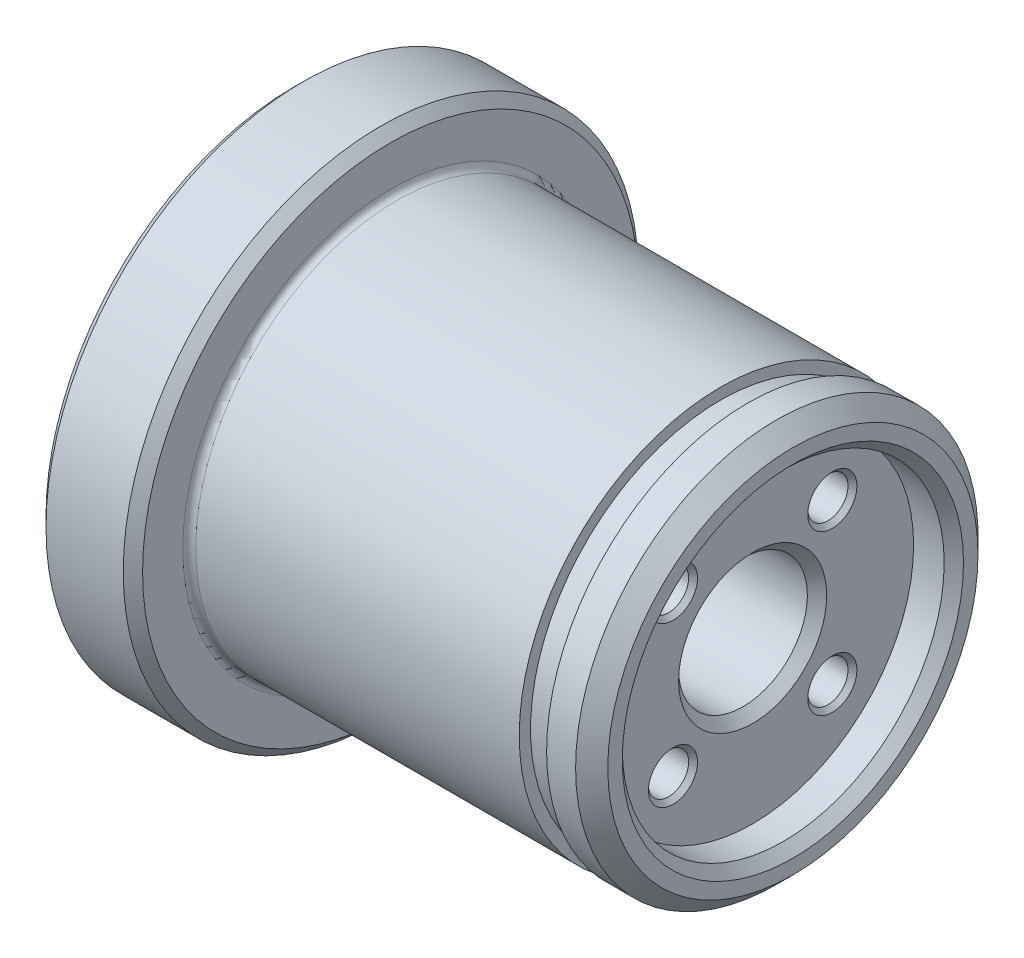
ISO-10303-21;
HEADER;
FILE_DESCRIPTION(('STEP AP214'),'2;1');
FILE_NAME('part.step','',(''),(''),'','','');
FILE_SCHEMA(('AUTOMOTIVE_DESIGN { 1 0 10303 214 1 1 1 1 }'));
ENDSEC;
DATA;
#1=APPLICATION_CONTEXT('core data for automotive mechanical design processes');
#2=APPLICATION_PROTOCOL_DEFINITION('international standard','automotive_design',2000,#1);
#3=PRODUCT_CONTEXT('',#1,'mechanical');
#4=PRODUCT('Part','Part','',(#3));
#5=PRODUCT_RELATED_PRODUCT_CATEGORY('part','',(#4));
#6=PRODUCT_DEFINITION_FORMATION('','',#4);
#7=PRODUCT_DEFINITION_CONTEXT('part definition',#1,'design');
#8=PRODUCT_DEFINITION('design','',#6,#7);
#9=PRODUCT_DEFINITION_SHAPE('','',#8);
#10=(LENGTH_UNIT() NAMED_UNIT(*) SI_UNIT(.MILLI.,.METRE.));
#11=(NAMED_UNIT(*) PLANE_ANGLE_UNIT() SI_UNIT($,.RADIAN.));
#12=(NAMED_UNIT(*) SI_UNIT($,.STERADIAN.) SOLID_ANGLE_UNIT());
#13=UNCERTAINTY_MEASURE_WITH_UNIT(LENGTH_MEASURE(1.E-05),#10,'distance_accuracy_value','');
#14=(GEOMETRIC_REPRESENTATION_CONTEXT(3) GLOBAL_UNCERTAINTY_ASSIGNED_CONTEXT((#13)) GLOBAL_UNIT_ASSIGNED_CONTEXT((#10,
#11,#12)) REPRESENTATION_CONTEXT('',''));
#15=CARTESIAN_POINT('',(0.,0.,0.));
#16=DIRECTION('',(0.,0.,1.));
#17=DIRECTION('',(1.,0.,0.));
#18=AXIS2_PLACEMENT_3D('',#15,#16,#17);
#19=CARTESIAN_POINT('',(0.,0.,0.));
#20=DIRECTION('',(-1.,0.,0.));
#21=DIRECTION('',(0.,0.,1.));
#22=AXIS2_PLACEMENT_3D('',#19,#20,#21);
#23=CYLINDRICAL_SURFACE('',#22,12.5);
#24=CARTESIAN_POINT('',(-24.6,0.,0.));
#25=DIRECTION('',(-1.,0.,0.));
#26=DIRECTION('',(0.,0.,1.));
#27=AXIS2_PLACEMENT_3D('',#24,#25,#26);
#28=CIRCLE('',#27,12.5);
#29=CARTESIAN_POINT('',(-24.6,0.,12.5));
#30=VERTEX_POINT('',#29);
#31=EDGE_CURVE('E176',#30,#30,#28,.F.);
#32=ORIENTED_EDGE('',*,*,#31,.T.);
#33=EDGE_LOOP('',(#32));
#34=FACE_BOUND('',#33,.T.);
#35=CARTESIAN_POINT('',(-4.50000000000001,0.,0.));
#36=DIRECTION('',(1.,0.,0.));
#37=DIRECTION('',(0.,0.,-1.));
#38=AXIS2_PLACEMENT_3D('',#35,#36,#37);
#39=CIRCLE('',#38,12.5);
#40=CARTESIAN_POINT('',(-4.50000000000001,0.,-12.5));
#41=VERTEX_POINT('',#40);
#42=EDGE_CURVE('E164',#41,#41,#39,.T.);
#43=ORIENTED_EDGE('',*,*,#42,.F.);
#44=EDGE_LOOP('',(#43));
#45=FACE_BOUND('',#44,.T.);
#46=ADVANCED_FACE('F39',(#34,#45),#23,.T.);
#47=CARTESIAN_POINT('',(-25.,12.5,0.));
#48=DIRECTION('',(-1.,0.,0.));
#49=DIRECTION('',(0.,0.,1.));
#50=AXIS2_PLACEMENT_3D('',#47,#48,#49);
#51=PLANE('',#50);
#52=CARTESIAN_POINT('',(-25.,0.,0.));
#53=DIRECTION('',(-1.,0.,0.));
#54=DIRECTION('',(0.,0.,1.));
#55=AXIS2_PLACEMENT_3D('',#52,#53,#54);
#56=CIRCLE('',#55,15.4);
#57=CARTESIAN_POINT('',(-25.,0.,15.4));
#58=VERTEX_POINT('',#57);
#59=EDGE_CURVE('E11',#58,#58,#56,.F.);
#60=ORIENTED_EDGE('',*,*,#59,.T.);
#61=EDGE_LOOP('',(#60));
#62=FACE_BOUND('',#61,.T.);
#63=CARTESIAN_POINT('',(-25.,0.,0.));
#64=DIRECTION('',(-1.,0.,0.));
#65=DIRECTION('',(0.,0.,1.));
#66=AXIS2_PLACEMENT_3D('',#63,#64,#65);
#67=CIRCLE('',#66,12.9);
#68=CARTESIAN_POINT('',(-25.,0.,12.9));
#69=VERTEX_POINT('',#68);
#70=EDGE_CURVE('E173',#69,#69,#67,.T.);
#71=ORIENTED_EDGE('',*,*,#70,.T.);
#72=EDGE_LOOP('',(#71));
#73=FACE_BOUND('',#72,.T.);
#74=ADVANCED_FACE('F249',(#62,#73),#51,.F.);
#75=CARTESIAN_POINT('',(0.,0.,0.));
#76=DIRECTION('',(-1.,0.,0.));
#77=DIRECTION('',(0.,0.,1.));
#78=AXIS2_PLACEMENT_3D('',#75,#76,#77);
#79=CYLINDRICAL_SURFACE('',#78,16.);
#80=CARTESIAN_POINT('',(-30.4,0.,0.));
#81=DIRECTION('',(1.,0.,0.));
#82=DIRECTION('',(0.,0.,-1.));
#83=AXIS2_PLACEMENT_3D('',#80,#81,#82);
#84=CIRCLE('',#83,16.);
#85=CARTESIAN_POINT('',(-30.4,0.,-16.));
#86=VERTEX_POINT('',#85);
#87=EDGE_CURVE('E47',#86,#86,#84,.T.);
#88=ORIENTED_EDGE('',*,*,#87,.T.);
#89=EDGE_LOOP('',(#88));
#90=FACE_BOUND('',#89,.T.);
#91=CARTESIAN_POINT('',(-25.6,0.,0.));
#92=DIRECTION('',(-1.,0.,0.));
#93=DIRECTION('',(0.,0.,1.));
#94=AXIS2_PLACEMENT_3D('',#91,#92,#93);
#95=CIRCLE('',#94,16.);
#96=CARTESIAN_POINT('',(-25.6,0.,16.));
#97=VERTEX_POINT('',#96);
#98=EDGE_CURVE('E200',#97,#97,#95,.T.);
#99=ORIENTED_EDGE('',*,*,#98,.T.);
#100=EDGE_LOOP('',(#99));
#101=FACE_BOUND('',#100,.T.);
#102=ADVANCED_FACE('F205',(#90,#101),#79,.T.);
#103=CARTESIAN_POINT('',(-31.,16.,0.));
#104=DIRECTION('',(1.,0.,0.));
#105=DIRECTION('',(0.,0.,-1.));
#106=AXIS2_PLACEMENT_3D('',#103,#104,#105);
#107=PLANE('',#106);
#108=CARTESIAN_POINT('',(-31.,0.,0.));
#109=DIRECTION('',(1.,0.,0.));
#110=DIRECTION('',(0.,0.,-1.));
#111=AXIS2_PLACEMENT_3D('',#108,#109,#110);
#112=CIRCLE('',#111,15.4);
#113=CARTESIAN_POINT('',(-31.,0.,-15.4));
#114=VERTEX_POINT('',#113);
#115=EDGE_CURVE('E197',#114,#114,#112,.F.);
#116=ORIENTED_EDGE('',*,*,#115,.T.);
#117=EDGE_LOOP('',(#116));
#118=FACE_BOUND('',#117,.T.);
#119=CARTESIAN_POINT('',(-31.,-7.07106781186549,7.07106781186547));
#120=DIRECTION('',(-1.,0.,0.));
#121=DIRECTION('',(0.,-1.,0.));
#122=AXIS2_PLACEMENT_3D('',#119,#120,#121);
#123=CIRCLE('',#122,1.525);
#124=CARTESIAN_POINT('',(-31.,-8.59606781186549,7.07106781186546));
#125=VERTEX_POINT('',#124);
#126=EDGE_CURVE('E89',#125,#125,#123,.T.);
#127=ORIENTED_EDGE('',*,*,#126,.F.);
#128=EDGE_LOOP('',(#127));
#129=FACE_BOUND('',#128,.T.);
#130=CARTESIAN_POINT('',(-31.,-7.07106781186549,-7.07106781186546));
#131=DIRECTION('',(-1.,0.,0.));
#132=DIRECTION('',(0.,0.,-1.));
#133=AXIS2_PLACEMENT_3D('',#130,#131,#132);
#134=CIRCLE('',#133,1.525);
#135=CARTESIAN_POINT('',(-31.,-7.07106781186549,-8.59606781186546));
#136=VERTEX_POINT('',#135);
#137=EDGE_CURVE('E93',#136,#136,#134,.T.);
#138=ORIENTED_EDGE('',*,*,#137,.F.);
#139=EDGE_LOOP('',(#138));
#140=FACE_BOUND('',#139,.T.);
#141=CARTESIAN_POINT('',(-31.,7.07106781186554,-7.07106781186542));
#142=DIRECTION('',(-1.,0.,0.));
#143=DIRECTION('',(0.,1.,0.));
#144=AXIS2_PLACEMENT_3D('',#141,#142,#143);
#145=CIRCLE('',#144,1.525);
#146=CARTESIAN_POINT('',(-31.,8.59606781186554,-7.0710678118654));
#147=VERTEX_POINT('',#146);
#148=EDGE_CURVE('E103',#147,#147,#145,.T.);
#149=ORIENTED_EDGE('',*,*,#148,.F.);
#150=EDGE_LOOP('',(#149));
#151=FACE_BOUND('',#150,.T.);
#152=CARTESIAN_POINT('',(-31.,7.07106781186549,7.07106781186546));
#153=DIRECTION('',(-1.,0.,0.));
#154=DIRECTION('',(0.,0.,1.));
#155=AXIS2_PLACEMENT_3D('',#152,#153,#154);
#156=CIRCLE('',#155,1.525);
#157=CARTESIAN_POINT('',(-31.,7.07106781186549,8.59606781186546));
#158=VERTEX_POINT('',#157);
#159=EDGE_CURVE('E82',#158,#158,#156,.T.);
#160=ORIENTED_EDGE('',*,*,#159,.F.);
#161=EDGE_LOOP('',(#160));
#162=FACE_BOUND('',#161,.T.);
#163=CARTESIAN_POINT('',(-31.,0.,0.));
#164=DIRECTION('',(1.,0.,0.));
#165=DIRECTION('',(0.,0.,-1.));
#166=AXIS2_PLACEMENT_3D('',#163,#164,#165);
#167=CIRCLE('',#166,4.59999999999999);
#168=CARTESIAN_POINT('',(-31.,0.,-4.59999999999999));
#169=VERTEX_POINT('',#168);
#170=EDGE_CURVE('E185',#169,#169,#167,.T.);
#171=ORIENTED_EDGE('',*,*,#170,.T.);
#172=EDGE_LOOP('',(#171));
#173=FACE_BOUND('',#172,.T.);
#174=ADVANCED_FACE('F214',(#118,#129,#140,#151,#162,#173),#107,.F.);
#175=CARTESIAN_POINT('',(-4.50000000000001,12.5,0.));
#176=DIRECTION('',(-1.,0.,0.));
#177=DIRECTION('',(0.,0.,1.));
#178=AXIS2_PLACEMENT_3D('',#175,#176,#177);
#179=PLANE('',#178);
#180=CARTESIAN_POINT('',(-4.50000000000001,0.,0.));
#181=DIRECTION('',(1.,0.,0.));
#182=DIRECTION('',(0.,0.,-1.));
#183=AXIS2_PLACEMENT_3D('',#180,#181,#182);
#184=CIRCLE('',#183,11.8);
#185=CARTESIAN_POINT('',(-4.50000000000001,0.,-11.8));
#186=VERTEX_POINT('',#185);
#187=EDGE_CURVE('E161',#186,#186,#184,.T.);
#188=ORIENTED_EDGE('',*,*,#187,.F.);
#189=EDGE_LOOP('',(#188));
#190=FACE_BOUND('',#189,.T.);
#191=ORIENTED_EDGE('',*,*,#42,.T.);
#192=EDGE_LOOP('',(#191));
#193=FACE_BOUND('',#192,.T.);
#194=ADVANCED_FACE('F217',(#190,#193),#179,.F.);
#195=CARTESIAN_POINT('',(0.,0.,0.));
#196=DIRECTION('',(1.,0.,0.));
#197=DIRECTION('',(0.,0.,-1.));
#198=AXIS2_PLACEMENT_3D('',#195,#196,#197);
#199=CYLINDRICAL_SURFACE('',#198,11.8);
#200=CARTESIAN_POINT('',(-2.80000000000001,0.,0.));
#201=DIRECTION('',(1.,0.,0.));
#202=DIRECTION('',(0.,0.,-1.));
#203=AXIS2_PLACEMENT_3D('',#200,#201,#202);
#204=CIRCLE('',#203,11.8);
#205=CARTESIAN_POINT('',(-2.80000000000001,0.,-11.8));
#206=VERTEX_POINT('',#205);
#207=EDGE_CURVE('E158',#206,#206,#204,.T.);
#208=ORIENTED_EDGE('',*,*,#207,.F.);
#209=EDGE_LOOP('',(#208));
#210=FACE_BOUND('',#209,.T.);
#211=ORIENTED_EDGE('',*,*,#187,.T.);
#212=EDGE_LOOP('',(#211));
#213=FACE_BOUND('',#212,.T.);
#214=ADVANCED_FACE('F279',(#210,#213),#199,.T.);
#215=CARTESIAN_POINT('',(-2.80000000000001,11.8,0.));
#216=DIRECTION('',(1.,0.,0.));
#217=DIRECTION('',(0.,0.,-1.));
#218=AXIS2_PLACEMENT_3D('',#215,#216,#217);
#219=PLANE('',#218);
#220=CARTESIAN_POINT('',(-2.80000000000001,0.,0.));
#221=DIRECTION('',(1.,0.,0.));
#222=DIRECTION('',(0.,0.,-1.));
#223=AXIS2_PLACEMENT_3D('',#220,#221,#222);
#224=CIRCLE('',#223,12.5);
#225=CARTESIAN_POINT('',(-2.80000000000001,0.,-12.5));
#226=VERTEX_POINT('',#225);
#227=EDGE_CURVE('E155',#226,#226,#224,.T.);
#228=ORIENTED_EDGE('',*,*,#227,.F.);
#229=EDGE_LOOP('',(#228));
#230=FACE_BOUND('',#229,.T.);
#231=ORIENTED_EDGE('',*,*,#207,.T.);
#232=EDGE_LOOP('',(#231));
#233=FACE_BOUND('',#232,.T.);
#234=ADVANCED_FACE('F271',(#230,#233),#219,.F.);
#235=CARTESIAN_POINT('',(0.,0.,0.));
#236=DIRECTION('',(-1.,0.,0.));
#237=DIRECTION('',(0.,0.,1.));
#238=AXIS2_PLACEMENT_3D('',#235,#236,#237);
#239=PLANE('',#238);
#240=CARTESIAN_POINT('',(0.,0.,0.));
#241=DIRECTION('',(-1.,0.,0.));
#242=DIRECTION('',(0.,0.,1.));
#243=AXIS2_PLACEMENT_3D('',#240,#241,#242);
#244=CIRCLE('',#243,10.6);
#245=CARTESIAN_POINT('',(0.,0.,10.6));
#246=VERTEX_POINT('',#245);
#247=EDGE_CURVE('E182',#246,#246,#244,.T.);
#248=ORIENTED_EDGE('',*,*,#247,.T.);
#249=EDGE_LOOP('',(#248));
#250=FACE_BOUND('',#249,.T.);
#251=CARTESIAN_POINT('',(0.,0.,0.));
#252=DIRECTION('',(-1.,0.,0.));
#253=DIRECTION('',(0.,0.,1.));
#254=AXIS2_PLACEMENT_3D('',#251,#252,#253);
#255=CIRCLE('',#254,11.5);
#256=CARTESIAN_POINT('',(0.,0.,11.5));
#257=VERTEX_POINT('',#256);
#258=EDGE_CURVE('E170',#257,#257,#255,.F.);
#259=ORIENTED_EDGE('',*,*,#258,.T.);
#260=EDGE_LOOP('',(#259));
#261=FACE_BOUND('',#260,.T.);
#262=ADVANCED_FACE('F262',(#250,#261),#239,.F.);
#263=CARTESIAN_POINT('',(-0.999999999999996,0.,0.));
#264=DIRECTION('',(-1.,0.,0.));
#265=DIRECTION('',(0.,0.,1.));
#266=AXIS2_PLACEMENT_3D('',#263,#264,#265);
#267=CIRCLE('',#266,12.5);
#268=CARTESIAN_POINT('',(-0.999999999999996,0.,12.5));
#269=VERTEX_POINT('',#268);
#270=EDGE_CURVE('E167',#269,#269,#267,.T.);
#271=ORIENTED_EDGE('',*,*,#270,.T.);
#272=EDGE_LOOP('',(#271));
#273=FACE_BOUND('',#272,.T.);
#274=ORIENTED_EDGE('',*,*,#227,.T.);
#275=EDGE_LOOP('',(#274));
#276=FACE_BOUND('',#275,.T.);
#277=ADVANCED_FACE('F252',(#273,#276),#23,.T.);
#278=CARTESIAN_POINT('',(-0.999999999999996,0.,0.));
#279=DIRECTION('',(-1.,0.,0.));
#280=DIRECTION('',(0.,0.,1.));
#281=AXIS2_PLACEMENT_3D('',#278,#279,#280);
#282=CONICAL_SURFACE('',#281,12.5,0.785398163397451);
#283=ORIENTED_EDGE('',*,*,#258,.F.);
#284=EDGE_LOOP('',(#283));
#285=FACE_BOUND('',#284,.T.);
#286=ORIENTED_EDGE('',*,*,#270,.F.);
#287=EDGE_LOOP('',(#286));
#288=FACE_BOUND('',#287,.T.);
#289=ADVANCED_FACE('F261',(#285,#288),#282,.T.);
#290=CARTESIAN_POINT('',(-24.6,0.,0.));
#291=DIRECTION('',(-1.,0.,0.));
#292=DIRECTION('',(0.,0.,1.));
#293=AXIS2_PLACEMENT_3D('',#290,#291,#292);
#294=TOROIDAL_SURFACE('',#293,12.9,0.4);
#295=ORIENTED_EDGE('',*,*,#31,.F.);
#296=EDGE_LOOP('',(#295));
#297=FACE_BOUND('',#296,.T.);
#298=ORIENTED_EDGE('',*,*,#70,.F.);
#299=EDGE_LOOP('',(#298));
#300=FACE_BOUND('',#299,.T.);
#301=ADVANCED_FACE('F268',(#297,#300),#294,.F.);
#302=CARTESIAN_POINT('',(0.,0.,0.));
#303=DIRECTION('',(1.,0.,0.));
#304=DIRECTION('',(0.,0.,-1.));
#305=AXIS2_PLACEMENT_3D('',#302,#303,#304);
#306=CYLINDRICAL_SURFACE('',#305,10.);
#307=CARTESIAN_POINT('',(-0.599999999999998,0.,0.));
#308=DIRECTION('',(-1.,0.,0.));
#309=DIRECTION('',(0.,0.,1.));
#310=AXIS2_PLACEMENT_3D('',#307,#308,#309);
#311=CIRCLE('',#310,10.);
#312=CARTESIAN_POINT('',(-0.599999999999998,0.,10.));
#313=VERTEX_POINT('',#312);
#314=EDGE_CURVE('E179',#313,#313,#311,.F.);
#315=ORIENTED_EDGE('',*,*,#314,.T.);
#316=EDGE_LOOP('',(#315));
#317=FACE_BOUND('',#316,.T.);
#318=CARTESIAN_POINT('',(-2.5,0.,0.));
#319=DIRECTION('',(1.,0.,0.));
#320=DIRECTION('',(0.,0.,-1.));
#321=AXIS2_PLACEMENT_3D('',#318,#319,#320);
#322=CIRCLE('',#321,10.);
#323=CARTESIAN_POINT('',(-2.5,0.,-10.));
#324=VERTEX_POINT('',#323);
#325=EDGE_CURVE('E152',#324,#324,#322,.T.);
#326=ORIENTED_EDGE('',*,*,#325,.F.);
#327=EDGE_LOOP('',(#326));
#328=FACE_BOUND('',#327,.T.);
#329=ADVANCED_FACE('F332',(#317,#328),#306,.F.);
#330=CARTESIAN_POINT('',(-2.5,10.,0.));
#331=DIRECTION('',(-1.,0.,0.));
#332=DIRECTION('',(0.,0.,1.));
#333=AXIS2_PLACEMENT_3D('',#330,#331,#332);
#334=PLANE('',#333);
#335=CARTESIAN_POINT('',(-2.5,0.,0.));
#336=DIRECTION('',(-1.,0.,0.));
#337=DIRECTION('',(0.,0.,1.));
#338=AXIS2_PLACEMENT_3D('',#335,#336,#337);
#339=CIRCLE('',#338,4.59999999999998);
#340=CARTESIAN_POINT('',(-2.5,0.,4.59999999999998));
#341=VERTEX_POINT('',#340);
#342=EDGE_CURVE('E194',#341,#341,#339,.T.);
#343=ORIENTED_EDGE('',*,*,#342,.T.);
#344=EDGE_LOOP('',(#343));
#345=FACE_BOUND('',#344,.T.);
#346=CARTESIAN_POINT('',(-2.5,4.94974746830588,4.94974746830578));
#347=DIRECTION('',(1.,0.,0.));
#348=DIRECTION('',(0.,0.,-1.));
#349=AXIS2_PLACEMENT_3D('',#346,#347,#348);
#350=CIRCLE('',#349,1.525);
#351=CARTESIAN_POINT('',(-2.5,4.94974746830588,3.42474746830578));
#352=VERTEX_POINT('',#351);
#353=EDGE_CURVE('E116',#352,#352,#350,.T.);
#354=ORIENTED_EDGE('',*,*,#353,.F.);
#355=EDGE_LOOP('',(#354));
#356=FACE_BOUND('',#355,.T.);
#357=CARTESIAN_POINT('',(-2.5,-4.94974746830583,4.94974746830583));
#358=DIRECTION('',(1.,0.,0.));
#359=DIRECTION('',(0.,0.,-1.));
#360=AXIS2_PLACEMENT_3D('',#357,#358,#359);
#361=CIRCLE('',#360,1.525);
#362=CARTESIAN_POINT('',(-2.5,-4.94974746830583,3.42474746830583));
#363=VERTEX_POINT('',#362);
#364=EDGE_CURVE('E125',#363,#363,#361,.T.);
#365=ORIENTED_EDGE('',*,*,#364,.F.);
#366=EDGE_LOOP('',(#365));
#367=FACE_BOUND('',#366,.T.);
#368=CARTESIAN_POINT('',(-2.5,-4.94974746830585,-4.94974746830581));
#369=DIRECTION('',(1.,0.,0.));
#370=DIRECTION('',(0.,0.,-1.));
#371=AXIS2_PLACEMENT_3D('',#368,#369,#370);
#372=CIRCLE('',#371,1.525);
#373=CARTESIAN_POINT('',(-2.5,-4.94974746830585,-6.47474746830582));
#374=VERTEX_POINT('',#373);
#375=EDGE_CURVE('E134',#374,#374,#372,.T.);
#376=ORIENTED_EDGE('',*,*,#375,.F.);
#377=EDGE_LOOP('',(#376));
#378=FACE_BOUND('',#377,.T.);
#379=CARTESIAN_POINT('',(-2.5,4.94974746830583,-4.94974746830583));
#380=DIRECTION('',(1.,0.,0.));
#381=DIRECTION('',(0.,0.,-1.));
#382=AXIS2_PLACEMENT_3D('',#379,#380,#381);
#383=CIRCLE('',#382,1.525);
#384=CARTESIAN_POINT('',(-2.5,4.94974746830583,-6.47474746830583));
#385=VERTEX_POINT('',#384);
#386=EDGE_CURVE('E143',#385,#385,#383,.T.);
#387=ORIENTED_EDGE('',*,*,#386,.F.);
#388=EDGE_LOOP('',(#387));
#389=FACE_BOUND('',#388,.T.);
#390=ORIENTED_EDGE('',*,*,#325,.T.);
#391=EDGE_LOOP('',(#390));
#392=FACE_BOUND('',#391,.T.);
#393=ADVANCED_FACE('F338',(#345,#356,#367,#378,#389,#392),#334,.F.);
#394=CARTESIAN_POINT('',(-9.5,4.94974746830583,-4.94974746830583));
#395=DIRECTION('',(1.,0.,0.));
#396=DIRECTION('',(0.,0.,-1.));
#397=AXIS2_PLACEMENT_3D('',#394,#395,#396);
#398=CONICAL_SURFACE('',#397,1.25,1.02974425867665);
#399=CARTESIAN_POINT('',(-10.2510757737845,4.94974746830583,-4.94974746830583));
#400=VERTEX_POINT('',#399);
#401=VERTEX_LOOP('',#400);
#402=FACE_BOUND('',#401,.T.);
#403=CARTESIAN_POINT('',(-9.5,4.94974746830583,-4.94974746830583));
#404=DIRECTION('',(1.,0.,0.));
#405=DIRECTION('',(0.,0.,-1.));
#406=AXIS2_PLACEMENT_3D('',#403,#404,#405);
#407=CIRCLE('',#406,1.25);
#408=CARTESIAN_POINT('',(-9.5,4.94974746830583,-6.19974746830583));
#409=VERTEX_POINT('',#408);
#410=EDGE_CURVE('E149',#409,#409,#407,.T.);
#411=ORIENTED_EDGE('',*,*,#410,.T.);
#412=EDGE_LOOP('',(#411));
#413=FACE_BOUND('',#412,.T.);
#414=ADVANCED_FACE('F358',(#402,#413),#398,.F.);
#415=CARTESIAN_POINT('',(-2.5,4.94974746830583,-4.94974746830583));
#416=DIRECTION('',(1.,0.,0.));
#417=DIRECTION('',(0.,0.,-1.));
#418=AXIS2_PLACEMENT_3D('',#415,#416,#417);
#419=CYLINDRICAL_SURFACE('',#418,1.25);
#420=ORIENTED_EDGE('',*,*,#410,.F.);
#421=EDGE_LOOP('',(#420));
#422=FACE_BOUND('',#421,.T.);
#423=CARTESIAN_POINT('',(-2.775,4.94974746830583,-4.94974746830583));
#424=DIRECTION('',(1.,0.,0.));
#425=DIRECTION('',(0.,0.,-1.));
#426=AXIS2_PLACEMENT_3D('',#423,#424,#425);
#427=CIRCLE('',#426,1.25);
#428=CARTESIAN_POINT('',(-2.775,4.94974746830583,-6.19974746830583));
#429=VERTEX_POINT('',#428);
#430=EDGE_CURVE('E146',#429,#429,#427,.T.);
#431=ORIENTED_EDGE('',*,*,#430,.T.);
#432=EDGE_LOOP('',(#431));
#433=FACE_BOUND('',#432,.T.);
#434=ADVANCED_FACE('F364',(#422,#433),#419,.F.);
#435=CARTESIAN_POINT('',(-2.5,4.94974746830583,-4.94974746830583));
#436=DIRECTION('',(1.,0.,0.));
#437=DIRECTION('',(0.,0.,-1.));
#438=AXIS2_PLACEMENT_3D('',#435,#436,#437);
#439=CONICAL_SURFACE('',#438,1.525,0.78539816339745);
#440=ORIENTED_EDGE('',*,*,#430,.F.);
#441=EDGE_LOOP('',(#440));
#442=FACE_BOUND('',#441,.T.);
#443=ORIENTED_EDGE('',*,*,#386,.T.);
#444=EDGE_LOOP('',(#443));
#445=FACE_BOUND('',#444,.T.);
#446=ADVANCED_FACE('F370',(#442,#445),#439,.F.);
#447=CARTESIAN_POINT('',(-9.5,-4.94974746830585,-4.94974746830581));
#448=DIRECTION('',(1.,0.,0.));
#449=DIRECTION('',(0.,0.,-1.));
#450=AXIS2_PLACEMENT_3D('',#447,#448,#449);
#451=CONICAL_SURFACE('',#450,1.25,1.02974425867665);
#452=CARTESIAN_POINT('',(-10.2510757737845,-4.94974746830585,-4.94974746830581));
#453=VERTEX_POINT('',#452);
#454=VERTEX_LOOP('',#453);
#455=FACE_BOUND('',#454,.T.);
#456=CARTESIAN_POINT('',(-9.5,-4.94974746830585,-4.94974746830581));
#457=DIRECTION('',(1.,0.,0.));
#458=DIRECTION('',(0.,0.,-1.));
#459=AXIS2_PLACEMENT_3D('',#456,#457,#458);
#460=CIRCLE('',#459,1.25);
#461=CARTESIAN_POINT('',(-9.5,-4.94974746830585,-6.19974746830581));
#462=VERTEX_POINT('',#461);
#463=EDGE_CURVE('E140',#462,#462,#460,.T.);
#464=ORIENTED_EDGE('',*,*,#463,.T.);
#465=EDGE_LOOP('',(#464));
#466=FACE_BOUND('',#465,.T.);
#467=ADVANCED_FACE('F374',(#455,#466),#451,.F.);
#468=CARTESIAN_POINT('',(-2.5,-4.94974746830585,-4.94974746830581));
#469=DIRECTION('',(1.,0.,0.));
#470=DIRECTION('',(0.,0.,-1.));
#471=AXIS2_PLACEMENT_3D('',#468,#469,#470);
#472=CYLINDRICAL_SURFACE('',#471,1.25);
#473=ORIENTED_EDGE('',*,*,#463,.F.);
#474=EDGE_LOOP('',(#473));
#475=FACE_BOUND('',#474,.T.);
#476=CARTESIAN_POINT('',(-2.775,-4.94974746830585,-4.94974746830581));
#477=DIRECTION('',(1.,0.,0.));
#478=DIRECTION('',(0.,0.,-1.));
#479=AXIS2_PLACEMENT_3D('',#476,#477,#478);
#480=CIRCLE('',#479,1.25);
#481=CARTESIAN_POINT('',(-2.775,-4.94974746830585,-6.19974746830581));
#482=VERTEX_POINT('',#481);
#483=EDGE_CURVE('E137',#482,#482,#480,.T.);
#484=ORIENTED_EDGE('',*,*,#483,.T.);
#485=EDGE_LOOP('',(#484));
#486=FACE_BOUND('',#485,.T.);
#487=ADVANCED_FACE('F378',(#475,#486),#472,.F.);
#488=CARTESIAN_POINT('',(-2.5,-4.94974746830585,-4.94974746830581));
#489=DIRECTION('',(1.,0.,0.));
#490=DIRECTION('',(0.,0.,-1.));
#491=AXIS2_PLACEMENT_3D('',#488,#489,#490);
#492=CONICAL_SURFACE('',#491,1.525,0.785398163397449);
#493=ORIENTED_EDGE('',*,*,#483,.F.);
#494=EDGE_LOOP('',(#493));
#495=FACE_BOUND('',#494,.T.);
#496=ORIENTED_EDGE('',*,*,#375,.T.);
#497=EDGE_LOOP('',(#496));
#498=FACE_BOUND('',#497,.T.);
#499=ADVANCED_FACE('F381',(#495,#498),#492,.F.);
#500=CARTESIAN_POINT('',(-9.5,-4.94974746830583,4.94974746830583));
#501=DIRECTION('',(1.,0.,0.));
#502=DIRECTION('',(0.,0.,-1.));
#503=AXIS2_PLACEMENT_3D('',#500,#501,#502);
#504=CONICAL_SURFACE('',#503,1.25,1.02974425867665);
#505=CARTESIAN_POINT('',(-10.2510757737845,-4.94974746830583,4.94974746830583));
#506=VERTEX_POINT('',#505);
#507=VERTEX_LOOP('',#506);
#508=FACE_BOUND('',#507,.T.);
#509=CARTESIAN_POINT('',(-9.5,-4.94974746830583,4.94974746830583));
#510=DIRECTION('',(1.,0.,0.));
#511=DIRECTION('',(0.,0.,-1.));
#512=AXIS2_PLACEMENT_3D('',#509,#510,#511);
#513=CIRCLE('',#512,1.25);
#514=CARTESIAN_POINT('',(-9.5,-4.94974746830583,3.69974746830583));
#515=VERTEX_POINT('',#514);
#516=EDGE_CURVE('E131',#515,#515,#513,.T.);
#517=ORIENTED_EDGE('',*,*,#516,.T.);
#518=EDGE_LOOP('',(#517));
#519=FACE_BOUND('',#518,.T.);
#520=ADVANCED_FACE('F385',(#508,#519),#504,.F.);
#521=CARTESIAN_POINT('',(-2.5,-4.94974746830583,4.94974746830583));
#522=DIRECTION('',(1.,0.,0.));
#523=DIRECTION('',(0.,0.,-1.));
#524=AXIS2_PLACEMENT_3D('',#521,#522,#523);
#525=CYLINDRICAL_SURFACE('',#524,1.25);
#526=ORIENTED_EDGE('',*,*,#516,.F.);
#527=EDGE_LOOP('',(#526));
#528=FACE_BOUND('',#527,.T.);
#529=CARTESIAN_POINT('',(-2.775,-4.94974746830583,4.94974746830583));
#530=DIRECTION('',(1.,0.,0.));
#531=DIRECTION('',(0.,0.,-1.));
#532=AXIS2_PLACEMENT_3D('',#529,#530,#531);
#533=CIRCLE('',#532,1.25);
#534=CARTESIAN_POINT('',(-2.775,-4.94974746830583,3.69974746830583));
#535=VERTEX_POINT('',#534);
#536=EDGE_CURVE('E128',#535,#535,#533,.T.);
#537=ORIENTED_EDGE('',*,*,#536,.T.);
#538=EDGE_LOOP('',(#537));
#539=FACE_BOUND('',#538,.T.);
#540=ADVANCED_FACE('F389',(#528,#539),#525,.F.);
#541=CARTESIAN_POINT('',(-2.5,-4.94974746830583,4.94974746830583));
#542=DIRECTION('',(1.,0.,0.));
#543=DIRECTION('',(0.,0.,-1.));
#544=AXIS2_PLACEMENT_3D('',#541,#542,#543);
#545=CONICAL_SURFACE('',#544,1.525,0.785398163397449);
#546=ORIENTED_EDGE('',*,*,#536,.F.);
#547=EDGE_LOOP('',(#546));
#548=FACE_BOUND('',#547,.T.);
#549=ORIENTED_EDGE('',*,*,#364,.T.);
#550=EDGE_LOOP('',(#549));
#551=FACE_BOUND('',#550,.T.);
#552=ADVANCED_FACE('F393',(#548,#551),#545,.F.);
#553=CARTESIAN_POINT('',(-9.5,4.94974746830588,4.94974746830578));
#554=DIRECTION('',(1.,0.,0.));
#555=DIRECTION('',(0.,0.,-1.));
#556=AXIS2_PLACEMENT_3D('',#553,#554,#555);
#557=CONICAL_SURFACE('',#556,1.25,1.02974425867665);
#558=CARTESIAN_POINT('',(-10.2510757737845,4.94974746830588,4.94974746830578));
#559=VERTEX_POINT('',#558);
#560=VERTEX_LOOP('',#559);
#561=FACE_BOUND('',#560,.T.);
#562=CARTESIAN_POINT('',(-9.5,4.94974746830588,4.94974746830578));
#563=DIRECTION('',(1.,0.,0.));
#564=DIRECTION('',(0.,0.,-1.));
#565=AXIS2_PLACEMENT_3D('',#562,#563,#564);
#566=CIRCLE('',#565,1.25);
#567=CARTESIAN_POINT('',(-9.5,4.94974746830588,3.69974746830578));
#568=VERTEX_POINT('',#567);
#569=EDGE_CURVE('E122',#568,#568,#566,.T.);
#570=ORIENTED_EDGE('',*,*,#569,.T.);
#571=EDGE_LOOP('',(#570));
#572=FACE_BOUND('',#571,.T.);
#573=ADVANCED_FACE('F397',(#561,#572),#557,.F.);
#574=CARTESIAN_POINT('',(-2.5,4.94974746830588,4.94974746830578));
#575=DIRECTION('',(1.,0.,0.));
#576=DIRECTION('',(0.,0.,-1.));
#577=AXIS2_PLACEMENT_3D('',#574,#575,#576);
#578=CYLINDRICAL_SURFACE('',#577,1.25);
#579=ORIENTED_EDGE('',*,*,#569,.F.);
#580=EDGE_LOOP('',(#579));
#581=FACE_BOUND('',#580,.T.);
#582=CARTESIAN_POINT('',(-2.775,4.94974746830588,4.94974746830578));
#583=DIRECTION('',(1.,0.,0.));
#584=DIRECTION('',(0.,0.,-1.));
#585=AXIS2_PLACEMENT_3D('',#582,#583,#584);
#586=CIRCLE('',#585,1.25);
#587=CARTESIAN_POINT('',(-2.775,4.94974746830588,3.69974746830578));
#588=VERTEX_POINT('',#587);
#589=EDGE_CURVE('E119',#588,#588,#586,.T.);
#590=ORIENTED_EDGE('',*,*,#589,.T.);
#591=EDGE_LOOP('',(#590));
#592=FACE_BOUND('',#591,.T.);
#593=ADVANCED_FACE('F348',(#581,#592),#578,.F.);
#594=CARTESIAN_POINT('',(-2.5,4.94974746830588,4.94974746830578));
#595=DIRECTION('',(1.,0.,0.));
#596=DIRECTION('',(0.,0.,-1.));
#597=AXIS2_PLACEMENT_3D('',#594,#595,#596);
#598=CONICAL_SURFACE('',#597,1.525,0.78539816339745);
#599=ORIENTED_EDGE('',*,*,#589,.F.);
#600=EDGE_LOOP('',(#599));
#601=FACE_BOUND('',#600,.T.);
#602=ORIENTED_EDGE('',*,*,#353,.T.);
#603=EDGE_LOOP('',(#602));
#604=FACE_BOUND('',#603,.T.);
#605=ADVANCED_FACE('F343',(#601,#604),#598,.F.);
#606=CARTESIAN_POINT('',(-0.599999999999998,0.,0.));
#607=DIRECTION('',(1.,0.,0.));
#608=DIRECTION('',(0.,0.,-1.));
#609=AXIS2_PLACEMENT_3D('',#606,#607,#608);
#610=CONICAL_SURFACE('',#609,10.,0.785398163397448);
#611=ORIENTED_EDGE('',*,*,#247,.F.);
#612=EDGE_LOOP('',(#611));
#613=FACE_BOUND('',#612,.T.);
#614=ORIENTED_EDGE('',*,*,#314,.F.);
#615=EDGE_LOOP('',(#614));
#616=FACE_BOUND('',#615,.T.);
#617=ADVANCED_FACE('F243',(#613,#616),#610,.F.);
#618=CARTESIAN_POINT('',(0.,0.,0.));
#619=DIRECTION('',(1.,0.,0.));
#620=DIRECTION('',(0.,0.,-1.));
#621=AXIS2_PLACEMENT_3D('',#618,#619,#620);
#622=CYLINDRICAL_SURFACE('',#621,4.);
#623=CARTESIAN_POINT('',(-30.4,0.,0.));
#624=DIRECTION('',(1.,0.,0.));
#625=DIRECTION('',(0.,0.,-1.));
#626=AXIS2_PLACEMENT_3D('',#623,#624,#625);
#627=CIRCLE('',#626,4.);
#628=CARTESIAN_POINT('',(-30.4,0.,-4.));
#629=VERTEX_POINT('',#628);
#630=EDGE_CURVE('E191',#629,#629,#627,.F.);
#631=ORIENTED_EDGE('',*,*,#630,.T.);
#632=EDGE_LOOP('',(#631));
#633=FACE_BOUND('',#632,.T.);
#634=CARTESIAN_POINT('',(-3.09999999999999,0.,0.));
#635=DIRECTION('',(-1.,0.,0.));
#636=DIRECTION('',(0.,0.,1.));
#637=AXIS2_PLACEMENT_3D('',#634,#635,#636);
#638=CIRCLE('',#637,4.);
#639=CARTESIAN_POINT('',(-3.09999999999999,0.,4.));
#640=VERTEX_POINT('',#639);
#641=EDGE_CURVE('E188',#640,#640,#638,.F.);
#642=ORIENTED_EDGE('',*,*,#641,.T.);
#643=EDGE_LOOP('',(#642));
#644=FACE_BOUND('',#643,.T.);
#645=ADVANCED_FACE('F233',(#633,#644),#622,.F.);
#646=CARTESIAN_POINT('',(-31.,0.,0.));
#647=DIRECTION('',(-1.,0.,0.));
#648=DIRECTION('',(0.,0.,1.));
#649=AXIS2_PLACEMENT_3D('',#646,#647,#648);
#650=CONICAL_SURFACE('',#649,4.59999999999999,0.785398163397443);
#651=ORIENTED_EDGE('',*,*,#630,.F.);
#652=EDGE_LOOP('',(#651));
#653=FACE_BOUND('',#652,.T.);
#654=ORIENTED_EDGE('',*,*,#170,.F.);
#655=EDGE_LOOP('',(#654));
#656=FACE_BOUND('',#655,.T.);
#657=ADVANCED_FACE('F230',(#653,#656),#650,.F.);
#658=CARTESIAN_POINT('',(-2.5,0.,0.));
#659=DIRECTION('',(1.,0.,0.));
#660=DIRECTION('',(0.,0.,-1.));
#661=AXIS2_PLACEMENT_3D('',#658,#659,#660);
#662=CONICAL_SURFACE('',#661,4.59999999999998,0.785398163397444);
#663=ORIENTED_EDGE('',*,*,#641,.F.);
#664=EDGE_LOOP('',(#663));
#665=FACE_BOUND('',#664,.T.);
#666=ORIENTED_EDGE('',*,*,#342,.F.);
#667=EDGE_LOOP('',(#666));
#668=FACE_BOUND('',#667,.T.);
#669=ADVANCED_FACE('F232',(#665,#668),#662,.F.);
#670=CARTESIAN_POINT('',(-23.,7.07106781186549,7.07106781186546));
#671=DIRECTION('',(-1.,0.,0.));
#672=DIRECTION('',(0.,0.,1.));
#673=AXIS2_PLACEMENT_3D('',#670,#671,#672);
#674=CONICAL_SURFACE('',#673,1.25,1.02974425867665);
#675=CARTESIAN_POINT('',(-22.2489242262155,7.07106781186549,7.07106781186546));
#676=VERTEX_POINT('',#675);
#677=VERTEX_LOOP('',#676);
#678=FACE_BOUND('',#677,.T.);
#679=CARTESIAN_POINT('',(-23.,7.07106781186549,7.07106781186546));
#680=DIRECTION('',(-1.,0.,0.));
#681=DIRECTION('',(0.,0.,1.));
#682=AXIS2_PLACEMENT_3D('',#679,#680,#681);
#683=CIRCLE('',#682,1.25);
#684=CARTESIAN_POINT('',(-23.,7.07106781186549,8.32106781186546));
#685=VERTEX_POINT('',#684);
#686=EDGE_CURVE('E113',#685,#685,#683,.T.);
#687=ORIENTED_EDGE('',*,*,#686,.T.);
#688=EDGE_LOOP('',(#687));
#689=FACE_BOUND('',#688,.T.);
#690=ADVANCED_FACE('F240',(#678,#689),#674,.F.);
#691=CARTESIAN_POINT('',(-31.,7.07106781186549,7.07106781186546));
#692=DIRECTION('',(-1.,0.,0.));
#693=DIRECTION('',(0.,0.,1.));
#694=AXIS2_PLACEMENT_3D('',#691,#692,#693);
#695=CYLINDRICAL_SURFACE('',#694,1.24999999999999);
#696=ORIENTED_EDGE('',*,*,#686,.F.);
#697=EDGE_LOOP('',(#696));
#698=FACE_BOUND('',#697,.T.);
#699=CARTESIAN_POINT('',(-30.725,7.07106781186549,7.07106781186546));
#700=DIRECTION('',(-1.,0.,0.));
#701=DIRECTION('',(0.,0.,1.));
#702=AXIS2_PLACEMENT_3D('',#699,#700,#701);
#703=CIRCLE('',#702,1.24999999999999);
#704=CARTESIAN_POINT('',(-30.725,7.07106781186549,8.32106781186545));
#705=VERTEX_POINT('',#704);
#706=EDGE_CURVE('E86',#705,#705,#703,.T.);
#707=ORIENTED_EDGE('',*,*,#706,.T.);
#708=EDGE_LOOP('',(#707));
#709=FACE_BOUND('',#708,.T.);
#710=ADVANCED_FACE('F407',(#698,#709),#695,.F.);
#711=CARTESIAN_POINT('',(-31.,7.07106781186549,7.07106781186546));
#712=DIRECTION('',(-1.,0.,0.));
#713=DIRECTION('',(0.,0.,1.));
#714=AXIS2_PLACEMENT_3D('',#711,#712,#713);
#715=CONICAL_SURFACE('',#714,1.525,0.785398163397467);
#716=ORIENTED_EDGE('',*,*,#706,.F.);
#717=EDGE_LOOP('',(#716));
#718=FACE_BOUND('',#717,.T.);
#719=ORIENTED_EDGE('',*,*,#159,.T.);
#720=EDGE_LOOP('',(#719));
#721=FACE_BOUND('',#720,.T.);
#722=ADVANCED_FACE('F411',(#718,#721),#715,.F.);
#723=CARTESIAN_POINT('',(-23.,7.07106781186554,-7.07106781186542));
#724=DIRECTION('',(-1.,0.,0.));
#725=DIRECTION('',(0.,1.,0.));
#726=AXIS2_PLACEMENT_3D('',#723,#724,#725);
#727=CONICAL_SURFACE('',#726,1.25,1.02974425867665);
#728=CARTESIAN_POINT('',(-22.2489242262155,7.07106781186554,-7.07106781186541));
#729=VERTEX_POINT('',#728);
#730=VERTEX_LOOP('',#729);
#731=FACE_BOUND('',#730,.T.);
#732=CARTESIAN_POINT('',(-23.,7.07106781186554,-7.07106781186542));
#733=DIRECTION('',(-1.,0.,0.));
#734=DIRECTION('',(0.,1.,0.));
#735=AXIS2_PLACEMENT_3D('',#732,#733,#734);
#736=CIRCLE('',#735,1.25);
#737=CARTESIAN_POINT('',(-23.,8.32106781186553,-7.0710678118654));
#738=VERTEX_POINT('',#737);
#739=EDGE_CURVE('E97',#738,#738,#736,.T.);
#740=ORIENTED_EDGE('',*,*,#739,.T.);
#741=EDGE_LOOP('',(#740));
#742=FACE_BOUND('',#741,.T.);
#743=ADVANCED_FACE('F415',(#731,#742),#727,.F.);
#744=CARTESIAN_POINT('',(-31.,7.07106781186554,-7.07106781186542));
#745=DIRECTION('',(-1.,0.,0.));
#746=DIRECTION('',(0.,1.,0.));
#747=AXIS2_PLACEMENT_3D('',#744,#745,#746);
#748=CYLINDRICAL_SURFACE('',#747,1.24999999999999);
#749=ORIENTED_EDGE('',*,*,#739,.F.);
#750=EDGE_LOOP('',(#749));
#751=FACE_BOUND('',#750,.T.);
#752=CARTESIAN_POINT('',(-30.725,7.07106781186554,-7.07106781186542));
#753=DIRECTION('',(-1.,0.,0.));
#754=DIRECTION('',(0.,1.,0.));
#755=AXIS2_PLACEMENT_3D('',#752,#753,#754);
#756=CIRCLE('',#755,1.24999999999999);
#757=CARTESIAN_POINT('',(-30.725,8.32106781186552,-7.0710678118654));
#758=VERTEX_POINT('',#757);
#759=EDGE_CURVE('E106',#758,#758,#756,.T.);
#760=ORIENTED_EDGE('',*,*,#759,.T.);
#761=EDGE_LOOP('',(#760));
#762=FACE_BOUND('',#761,.T.);
#763=ADVANCED_FACE('F419',(#751,#762),#748,.F.);
#764=CARTESIAN_POINT('',(-31.,7.07106781186554,-7.07106781186542));
#765=DIRECTION('',(-1.,0.,0.));
#766=DIRECTION('',(0.,1.,0.));
#767=AXIS2_PLACEMENT_3D('',#764,#765,#766);
#768=CONICAL_SURFACE('',#767,1.525,0.785398163397467);
#769=ORIENTED_EDGE('',*,*,#759,.F.);
#770=EDGE_LOOP('',(#769));
#771=FACE_BOUND('',#770,.T.);
#772=ORIENTED_EDGE('',*,*,#148,.T.);
#773=EDGE_LOOP('',(#772));
#774=FACE_BOUND('',#773,.T.);
#775=ADVANCED_FACE('F423',(#771,#774),#768,.F.);
#776=CARTESIAN_POINT('',(-23.,-7.07106781186549,-7.07106781186546));
#777=DIRECTION('',(-1.,0.,0.));
#778=DIRECTION('',(0.,0.,-1.));
#779=AXIS2_PLACEMENT_3D('',#776,#777,#778);
#780=CONICAL_SURFACE('',#779,1.25,1.02974425867665);
#781=CARTESIAN_POINT('',(-22.2489242262155,-7.07106781186549,-7.07106781186546));
#782=VERTEX_POINT('',#781);
#783=VERTEX_LOOP('',#782);
#784=FACE_BOUND('',#783,.T.);
#785=CARTESIAN_POINT('',(-23.,-7.07106781186549,-7.07106781186546));
#786=DIRECTION('',(-1.,0.,0.));
#787=DIRECTION('',(0.,0.,-1.));
#788=AXIS2_PLACEMENT_3D('',#785,#786,#787);
#789=CIRCLE('',#788,1.25);
#790=CARTESIAN_POINT('',(-23.,-7.07106781186549,-8.32106781186546));
#791=VERTEX_POINT('',#790);
#792=EDGE_CURVE('E100',#791,#791,#789,.T.);
#793=ORIENTED_EDGE('',*,*,#792,.T.);
#794=EDGE_LOOP('',(#793));
#795=FACE_BOUND('',#794,.T.);
#796=ADVANCED_FACE('F427',(#784,#795),#780,.F.);
#797=CARTESIAN_POINT('',(-31.,-7.07106781186549,-7.07106781186546));
#798=DIRECTION('',(-1.,0.,0.));
#799=DIRECTION('',(0.,0.,-1.));
#800=AXIS2_PLACEMENT_3D('',#797,#798,#799);
#801=CYLINDRICAL_SURFACE('',#800,1.24999999999999);
#802=ORIENTED_EDGE('',*,*,#792,.F.);
#803=EDGE_LOOP('',(#802));
#804=FACE_BOUND('',#803,.T.);
#805=CARTESIAN_POINT('',(-30.725,-7.07106781186549,-7.07106781186546));
#806=DIRECTION('',(-1.,0.,0.));
#807=DIRECTION('',(0.,0.,-1.));
#808=AXIS2_PLACEMENT_3D('',#805,#806,#807);
#809=CIRCLE('',#808,1.24999999999999);
#810=CARTESIAN_POINT('',(-30.725,-7.07106781186549,-8.32106781186545));
#811=VERTEX_POINT('',#810);
#812=EDGE_CURVE('E96',#811,#811,#809,.T.);
#813=ORIENTED_EDGE('',*,*,#812,.T.);
#814=EDGE_LOOP('',(#813));
#815=FACE_BOUND('',#814,.T.);
#816=ADVANCED_FACE('F431',(#804,#815),#801,.F.);
#817=CARTESIAN_POINT('',(-31.,-7.07106781186549,-7.07106781186546));
#818=DIRECTION('',(-1.,0.,0.));
#819=DIRECTION('',(0.,0.,-1.));
#820=AXIS2_PLACEMENT_3D('',#817,#818,#819);
#821=CONICAL_SURFACE('',#820,1.525,0.785398163397467);
#822=ORIENTED_EDGE('',*,*,#812,.F.);
#823=EDGE_LOOP('',(#822));
#824=FACE_BOUND('',#823,.T.);
#825=ORIENTED_EDGE('',*,*,#137,.T.);
#826=EDGE_LOOP('',(#825));
#827=FACE_BOUND('',#826,.T.);
#828=ADVANCED_FACE('F76',(#824,#827),#821,.F.);
#829=CARTESIAN_POINT('',(-23.,-7.07106781186549,7.07106781186547));
#830=DIRECTION('',(-1.,0.,0.));
#831=DIRECTION('',(0.,-1.,0.));
#832=AXIS2_PLACEMENT_3D('',#829,#830,#831);
#833=CONICAL_SURFACE('',#832,1.25,1.02974425867665);
#834=CARTESIAN_POINT('',(-22.2489242262155,-7.07106781186549,7.07106781186546));
#835=VERTEX_POINT('',#834);
#836=VERTEX_LOOP('',#835);
#837=FACE_BOUND('',#836,.T.);
#838=CARTESIAN_POINT('',(-23.,-7.07106781186549,7.07106781186547));
#839=DIRECTION('',(-1.,0.,0.));
#840=DIRECTION('',(0.,-1.,0.));
#841=AXIS2_PLACEMENT_3D('',#838,#839,#840);
#842=CIRCLE('',#841,1.25);
#843=CARTESIAN_POINT('',(-23.,-8.32106781186548,7.07106781186546));
#844=VERTEX_POINT('',#843);
#845=EDGE_CURVE('E80',#844,#844,#842,.T.);
#846=ORIENTED_EDGE('',*,*,#845,.T.);
#847=EDGE_LOOP('',(#846));
#848=FACE_BOUND('',#847,.T.);
#849=ADVANCED_FACE('F72',(#837,#848),#833,.F.);
#850=CARTESIAN_POINT('',(-31.,-7.07106781186549,7.07106781186547));
#851=DIRECTION('',(-1.,0.,0.));
#852=DIRECTION('',(0.,-1.,0.));
#853=AXIS2_PLACEMENT_3D('',#850,#851,#852);
#854=CYLINDRICAL_SURFACE('',#853,1.24999999999999);
#855=ORIENTED_EDGE('',*,*,#845,.F.);
#856=EDGE_LOOP('',(#855));
#857=FACE_BOUND('',#856,.T.);
#858=CARTESIAN_POINT('',(-30.725,-7.07106781186549,7.07106781186547));
#859=DIRECTION('',(-1.,0.,0.));
#860=DIRECTION('',(0.,-1.,0.));
#861=AXIS2_PLACEMENT_3D('',#858,#859,#860);
#862=CIRCLE('',#861,1.24999999999999);
#863=CARTESIAN_POINT('',(-30.725,-8.32106781186548,7.07106781186546));
#864=VERTEX_POINT('',#863);
#865=EDGE_CURVE('E83',#864,#864,#862,.T.);
#866=ORIENTED_EDGE('',*,*,#865,.T.);
#867=EDGE_LOOP('',(#866));
#868=FACE_BOUND('',#867,.T.);
#869=ADVANCED_FACE('F75',(#857,#868),#854,.F.);
#870=CARTESIAN_POINT('',(-31.,-7.07106781186549,7.07106781186547));
#871=DIRECTION('',(-1.,0.,0.));
#872=DIRECTION('',(0.,-1.,0.));
#873=AXIS2_PLACEMENT_3D('',#870,#871,#872);
#874=CONICAL_SURFACE('',#873,1.525,0.785398163397467);
#875=ORIENTED_EDGE('',*,*,#865,.F.);
#876=EDGE_LOOP('',(#875));
#877=FACE_BOUND('',#876,.T.);
#878=ORIENTED_EDGE('',*,*,#126,.T.);
#879=EDGE_LOOP('',(#878));
#880=FACE_BOUND('',#879,.T.);
#881=ADVANCED_FACE('F211',(#877,#880),#874,.F.);
#882=CARTESIAN_POINT('',(-31.,0.,0.));
#883=DIRECTION('',(1.,0.,0.));
#884=DIRECTION('',(0.,0.,-1.));
#885=AXIS2_PLACEMENT_3D('',#882,#883,#884);
#886=CONICAL_SURFACE('',#885,15.4,0.785398163397448);
#887=ORIENTED_EDGE('',*,*,#87,.F.);
#888=EDGE_LOOP('',(#887));
#889=FACE_BOUND('',#888,.T.);
#890=ORIENTED_EDGE('',*,*,#115,.F.);
#891=EDGE_LOOP('',(#890));
#892=FACE_BOUND('',#891,.T.);
#893=ADVANCED_FACE('F208',(#889,#892),#886,.T.);
#894=CARTESIAN_POINT('',(-25.6,0.,0.));
#895=DIRECTION('',(-1.,0.,0.));
#896=DIRECTION('',(0.,0.,1.));
#897=AXIS2_PLACEMENT_3D('',#894,#895,#896);
#898=CONICAL_SURFACE('',#897,16.,0.785398163397451);
#899=ORIENTED_EDGE('',*,*,#59,.F.);
#900=EDGE_LOOP('',(#899));
#901=FACE_BOUND('',#900,.T.);
#902=ORIENTED_EDGE('',*,*,#98,.F.);
#903=EDGE_LOOP('',(#902));
#904=FACE_BOUND('',#903,.T.);
#905=ADVANCED_FACE('F41',(#901,#904),#898,.T.);
#906=CLOSED_SHELL('',(#46,#74,#102,#174,#194,#214,#234,#262,#277,#289,#301,#329,#393,#414,#434,
#446,#467,#487,#499,#520,#540,#552,#573,#593,#605,#617,#645,#657,#669,#690,#710,#722,#743,#763,
#775,#796,#816,#828,#849,#869,#881,#893,#905));
#907=MANIFOLD_SOLID_BREP('B2',#906);
#908=ADVANCED_BREP_SHAPE_REPRESENTATION('',(#18,#907),#14);
#909=SHAPE_DEFINITION_REPRESENTATION(#9,#908);
ENDSEC;
END-ISO-10303-21;
